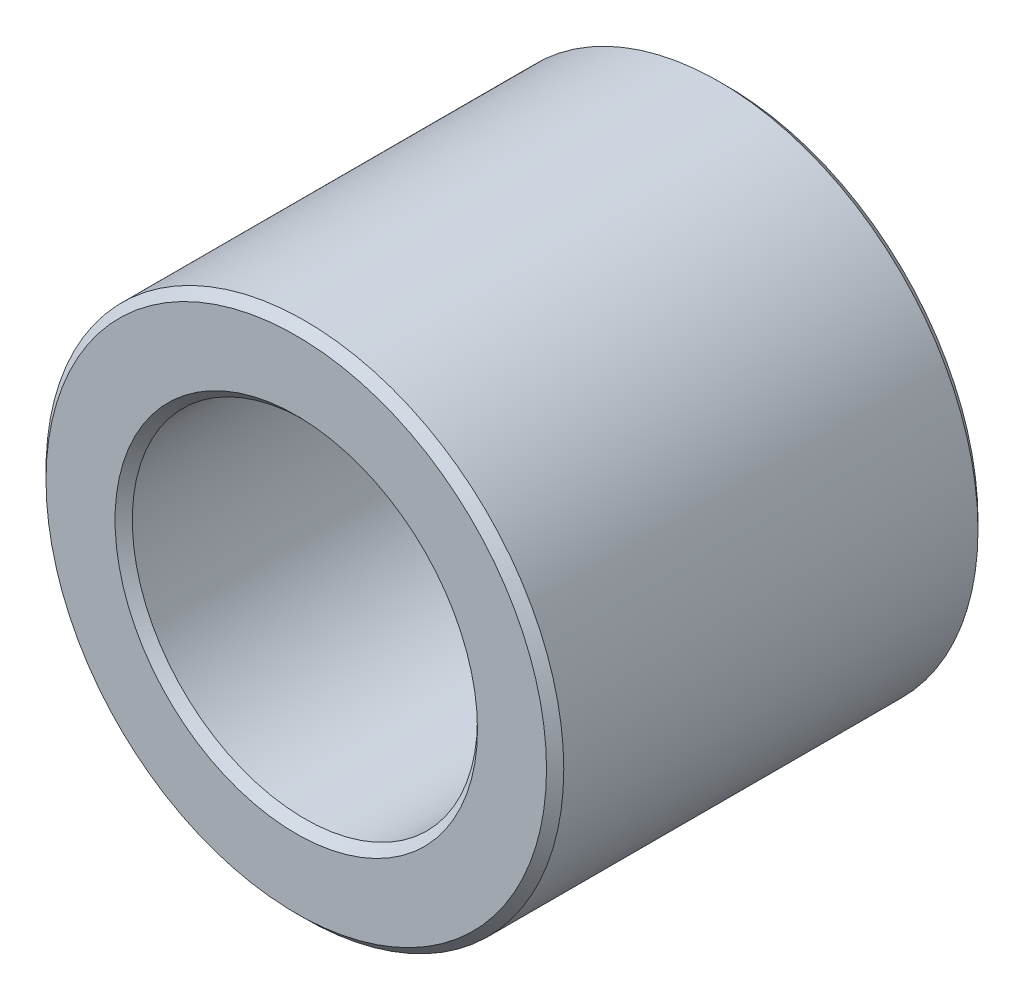
ISO-10303-21;
HEADER;
FILE_DESCRIPTION(('STEP AP214'),'2;1');
FILE_NAME('part.step','',(''),(''),'','','');
FILE_SCHEMA(('AUTOMOTIVE_DESIGN { 1 0 10303 214 1 1 1 1 }'));
ENDSEC;
DATA;
#1=APPLICATION_CONTEXT('core data for automotive mechanical design processes');
#2=APPLICATION_PROTOCOL_DEFINITION('international standard','automotive_design',2000,#1);
#3=PRODUCT_CONTEXT('',#1,'mechanical');
#4=PRODUCT('Part','Part','',(#3));
#5=PRODUCT_RELATED_PRODUCT_CATEGORY('part','',(#4));
#6=PRODUCT_DEFINITION_FORMATION('','',#4);
#7=PRODUCT_DEFINITION_CONTEXT('part definition',#1,'design');
#8=PRODUCT_DEFINITION('design','',#6,#7);
#9=PRODUCT_DEFINITION_SHAPE('','',#8);
#10=(LENGTH_UNIT() NAMED_UNIT(*) SI_UNIT(.MILLI.,.METRE.));
#11=(NAMED_UNIT(*) PLANE_ANGLE_UNIT() SI_UNIT($,.RADIAN.));
#12=(NAMED_UNIT(*) SI_UNIT($,.STERADIAN.) SOLID_ANGLE_UNIT());
#13=UNCERTAINTY_MEASURE_WITH_UNIT(LENGTH_MEASURE(1.E-05),#10,'distance_accuracy_value','');
#14=(GEOMETRIC_REPRESENTATION_CONTEXT(3) GLOBAL_UNCERTAINTY_ASSIGNED_CONTEXT((#13)) GLOBAL_UNIT_ASSIGNED_CONTEXT((#10,
#11,#12)) REPRESENTATION_CONTEXT('',''));
#15=CARTESIAN_POINT('',(0.,0.,0.));
#16=DIRECTION('',(0.,0.,1.));
#17=DIRECTION('',(1.,0.,0.));
#18=AXIS2_PLACEMENT_3D('',#15,#16,#17);
#19=CARTESIAN_POINT('',(0.,0.,10.));
#20=DIRECTION('',(0.,0.,1.));
#21=DIRECTION('',(1.,0.,0.));
#22=AXIS2_PLACEMENT_3D('',#19,#20,#21);
#23=PLANE('',#22);
#24=CARTESIAN_POINT('',(0.,0.,10.));
#25=DIRECTION('',(0.,0.,1.));
#26=DIRECTION('',(1.,0.,0.));
#27=AXIS2_PLACEMENT_3D('',#24,#25,#26);
#28=CIRCLE('',#27,4.2);
#29=CARTESIAN_POINT('',(4.2,0.,10.));
#30=VERTEX_POINT('',#29);
#31=EDGE_CURVE('E10',#30,#30,#28,.F.);
#32=ORIENTED_EDGE('',*,*,#31,.T.);
#33=EDGE_LOOP('',(#32));
#34=FACE_BOUND('',#33,.T.);
#35=CARTESIAN_POINT('',(0.,0.,10.));
#36=DIRECTION('',(0.,0.,1.));
#37=DIRECTION('',(1.,0.,0.));
#38=AXIS2_PLACEMENT_3D('',#35,#36,#37);
#39=CIRCLE('',#38,5.8);
#40=CARTESIAN_POINT('',(5.8,0.,10.));
#41=VERTEX_POINT('',#40);
#42=EDGE_CURVE('E39',#41,#41,#39,.T.);
#43=ORIENTED_EDGE('',*,*,#42,.T.);
#44=EDGE_LOOP('',(#43));
#45=FACE_BOUND('',#44,.T.);
#46=ADVANCED_FACE('F32',(#34,#45),#23,.T.);
#47=CARTESIAN_POINT('',(0.,0.,0.));
#48=DIRECTION('',(0.,0.,1.));
#49=DIRECTION('',(1.,0.,0.));
#50=AXIS2_PLACEMENT_3D('',#47,#48,#49);
#51=PLANE('',#50);
#52=CARTESIAN_POINT('',(0.,0.,0.));
#53=DIRECTION('',(0.,0.,1.));
#54=DIRECTION('',(1.,0.,0.));
#55=AXIS2_PLACEMENT_3D('',#52,#53,#54);
#56=CIRCLE('',#55,4.2);
#57=CARTESIAN_POINT('',(4.2,0.,0.));
#58=VERTEX_POINT('',#57);
#59=EDGE_CURVE('E58',#58,#58,#56,.T.);
#60=ORIENTED_EDGE('',*,*,#59,.T.);
#61=EDGE_LOOP('',(#60));
#62=FACE_BOUND('',#61,.T.);
#63=CARTESIAN_POINT('',(0.,0.,0.));
#64=DIRECTION('',(0.,0.,1.));
#65=DIRECTION('',(1.,0.,0.));
#66=AXIS2_PLACEMENT_3D('',#63,#64,#65);
#67=CIRCLE('',#66,5.8);
#68=CARTESIAN_POINT('',(5.8,0.,0.));
#69=VERTEX_POINT('',#68);
#70=EDGE_CURVE('E61',#69,#69,#67,.F.);
#71=ORIENTED_EDGE('',*,*,#70,.T.);
#72=EDGE_LOOP('',(#71));
#73=FACE_BOUND('',#72,.T.);
#74=ADVANCED_FACE('F65',(#62,#73),#51,.F.);
#75=CARTESIAN_POINT('',(0.,0.,10.));
#76=DIRECTION('',(0.,0.,-1.));
#77=DIRECTION('',(-1.,0.,0.));
#78=AXIS2_PLACEMENT_3D('',#75,#76,#77);
#79=CYLINDRICAL_SURFACE('',#78,6.);
#80=CARTESIAN_POINT('',(0.,0.,0.200000000000001));
#81=DIRECTION('',(0.,0.,1.));
#82=DIRECTION('',(1.,0.,0.));
#83=AXIS2_PLACEMENT_3D('',#80,#81,#82);
#84=CIRCLE('',#83,6.);
#85=CARTESIAN_POINT('',(6.,0.,0.200000000000001));
#86=VERTEX_POINT('',#85);
#87=EDGE_CURVE('E43',#86,#86,#84,.T.);
#88=ORIENTED_EDGE('',*,*,#87,.T.);
#89=EDGE_LOOP('',(#88));
#90=FACE_BOUND('',#89,.T.);
#91=CARTESIAN_POINT('',(0.,0.,9.8));
#92=DIRECTION('',(0.,0.,1.));
#93=DIRECTION('',(1.,0.,0.));
#94=AXIS2_PLACEMENT_3D('',#91,#92,#93);
#95=CIRCLE('',#94,6.);
#96=CARTESIAN_POINT('',(6.,0.,9.8));
#97=VERTEX_POINT('',#96);
#98=EDGE_CURVE('E47',#97,#97,#95,.F.);
#99=ORIENTED_EDGE('',*,*,#98,.T.);
#100=EDGE_LOOP('',(#99));
#101=FACE_BOUND('',#100,.T.);
#102=ADVANCED_FACE('F75',(#90,#101),#79,.T.);
#103=CARTESIAN_POINT('',(0.,0.,10.));
#104=DIRECTION('',(0.,0.,-1.));
#105=DIRECTION('',(-1.,0.,0.));
#106=AXIS2_PLACEMENT_3D('',#103,#104,#105);
#107=CYLINDRICAL_SURFACE('',#106,4.);
#108=CARTESIAN_POINT('',(0.,0.,0.200000000000001));
#109=DIRECTION('',(0.,0.,1.));
#110=DIRECTION('',(1.,0.,0.));
#111=AXIS2_PLACEMENT_3D('',#108,#109,#110);
#112=CIRCLE('',#111,4.);
#113=CARTESIAN_POINT('',(4.,0.,0.200000000000001));
#114=VERTEX_POINT('',#113);
#115=EDGE_CURVE('E52',#114,#114,#112,.F.);
#116=ORIENTED_EDGE('',*,*,#115,.T.);
#117=EDGE_LOOP('',(#116));
#118=FACE_BOUND('',#117,.T.);
#119=CARTESIAN_POINT('',(0.,0.,9.8));
#120=DIRECTION('',(0.,0.,1.));
#121=DIRECTION('',(1.,0.,0.));
#122=AXIS2_PLACEMENT_3D('',#119,#120,#121);
#123=CIRCLE('',#122,4.);
#124=CARTESIAN_POINT('',(4.,0.,9.8));
#125=VERTEX_POINT('',#124);
#126=EDGE_CURVE('E55',#125,#125,#123,.T.);
#127=ORIENTED_EDGE('',*,*,#126,.T.);
#128=EDGE_LOOP('',(#127));
#129=FACE_BOUND('',#128,.T.);
#130=ADVANCED_FACE('F78',(#118,#129),#107,.F.);
#131=CARTESIAN_POINT('',(0.,0.,0.));
#132=DIRECTION('',(0.,0.,-1.));
#133=DIRECTION('',(-1.,0.,0.));
#134=AXIS2_PLACEMENT_3D('',#131,#132,#133);
#135=CONICAL_SURFACE('',#134,4.2,0.785398163397448);
#136=ORIENTED_EDGE('',*,*,#115,.F.);
#137=EDGE_LOOP('',(#136));
#138=FACE_BOUND('',#137,.T.);
#139=ORIENTED_EDGE('',*,*,#59,.F.);
#140=EDGE_LOOP('',(#139));
#141=FACE_BOUND('',#140,.T.);
#142=ADVANCED_FACE('F71',(#138,#141),#135,.F.);
#143=CARTESIAN_POINT('',(0.,0.,0.200000000000001));
#144=DIRECTION('',(0.,0.,1.));
#145=DIRECTION('',(1.,0.,0.));
#146=AXIS2_PLACEMENT_3D('',#143,#144,#145);
#147=CONICAL_SURFACE('',#146,6.,0.785398163397448);
#148=ORIENTED_EDGE('',*,*,#70,.F.);
#149=EDGE_LOOP('',(#148));
#150=FACE_BOUND('',#149,.T.);
#151=ORIENTED_EDGE('',*,*,#87,.F.);
#152=EDGE_LOOP('',(#151));
#153=FACE_BOUND('',#152,.T.);
#154=ADVANCED_FACE('F67',(#150,#153),#147,.T.);
#155=CARTESIAN_POINT('',(0.,0.,9.8));
#156=DIRECTION('',(0.,0.,1.));
#157=DIRECTION('',(1.,0.,0.));
#158=AXIS2_PLACEMENT_3D('',#155,#156,#157);
#159=CONICAL_SURFACE('',#158,4.,0.785398163397444);
#160=ORIENTED_EDGE('',*,*,#31,.F.);
#161=EDGE_LOOP('',(#160));
#162=FACE_BOUND('',#161,.T.);
#163=ORIENTED_EDGE('',*,*,#126,.F.);
#164=EDGE_LOOP('',(#163));
#165=FACE_BOUND('',#164,.T.);
#166=ADVANCED_FACE('F70',(#162,#165),#159,.F.);
#167=CARTESIAN_POINT('',(0.,0.,10.));
#168=DIRECTION('',(0.,0.,-1.));
#169=DIRECTION('',(-1.,0.,0.));
#170=AXIS2_PLACEMENT_3D('',#167,#168,#169);
#171=CONICAL_SURFACE('',#170,5.8,0.785398163397453);
#172=ORIENTED_EDGE('',*,*,#98,.F.);
#173=EDGE_LOOP('',(#172));
#174=FACE_BOUND('',#173,.T.);
#175=ORIENTED_EDGE('',*,*,#42,.F.);
#176=EDGE_LOOP('',(#175));
#177=FACE_BOUND('',#176,.T.);
#178=ADVANCED_FACE('F34',(#174,#177),#171,.T.);
#179=CLOSED_SHELL('',(#46,#74,#102,#130,#142,#154,#166,#178));
#180=MANIFOLD_SOLID_BREP('B2',#179);
#181=ADVANCED_BREP_SHAPE_REPRESENTATION('',(#18,#180),#14);
#182=SHAPE_DEFINITION_REPRESENTATION(#9,#181);
ENDSEC;
END-ISO-10303-21;
